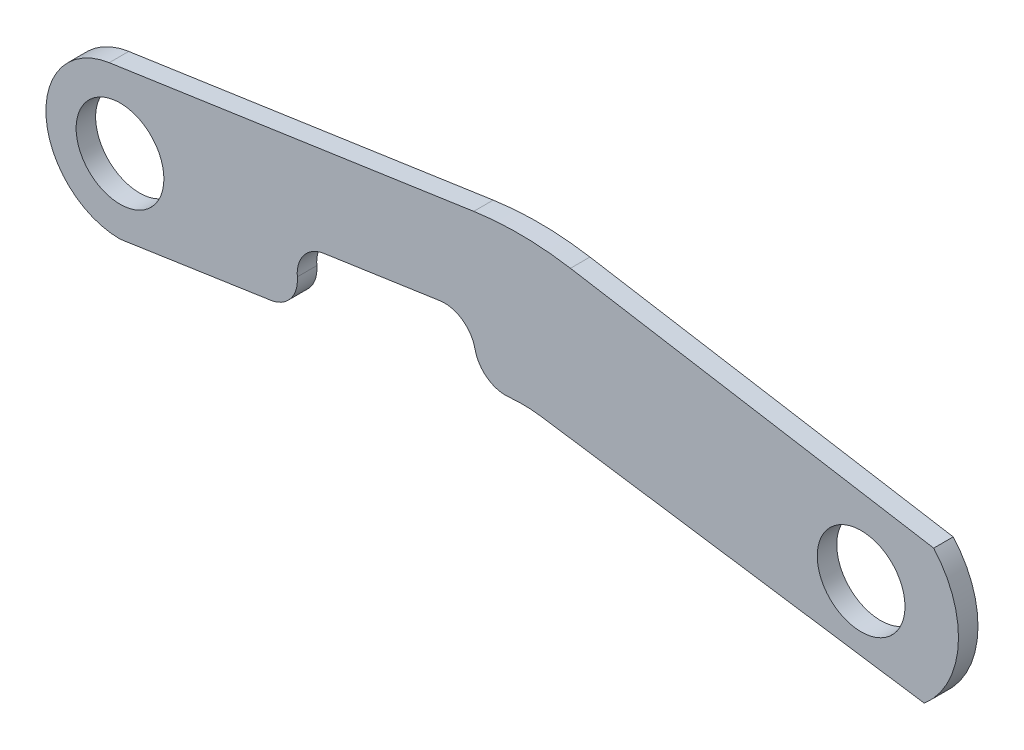
ISO-10303-21;
HEADER;
FILE_DESCRIPTION(('STEP AP214'),'2;1');
FILE_NAME('part.step','',(''),(''),'','','');
FILE_SCHEMA(('AUTOMOTIVE_DESIGN { 1 0 10303 214 1 1 1 1 }'));
ENDSEC;
DATA;
#1=APPLICATION_CONTEXT('core data for automotive mechanical design processes');
#2=APPLICATION_PROTOCOL_DEFINITION('international standard','automotive_design',2000,#1);
#3=PRODUCT_CONTEXT('',#1,'mechanical');
#4=PRODUCT('Part','Part','',(#3));
#5=PRODUCT_RELATED_PRODUCT_CATEGORY('part','',(#4));
#6=PRODUCT_DEFINITION_FORMATION('','',#4);
#7=PRODUCT_DEFINITION_CONTEXT('part definition',#1,'design');
#8=PRODUCT_DEFINITION('design','',#6,#7);
#9=PRODUCT_DEFINITION_SHAPE('','',#8);
#10=(LENGTH_UNIT() NAMED_UNIT(*) SI_UNIT(.MILLI.,.METRE.));
#11=(NAMED_UNIT(*) PLANE_ANGLE_UNIT() SI_UNIT($,.RADIAN.));
#12=(NAMED_UNIT(*) SI_UNIT($,.STERADIAN.) SOLID_ANGLE_UNIT());
#13=UNCERTAINTY_MEASURE_WITH_UNIT(LENGTH_MEASURE(1.E-05),#10,'distance_accuracy_value','');
#14=(GEOMETRIC_REPRESENTATION_CONTEXT(3) GLOBAL_UNCERTAINTY_ASSIGNED_CONTEXT((#13)) GLOBAL_UNIT_ASSIGNED_CONTEXT((#10,
#11,#12)) REPRESENTATION_CONTEXT('',''));
#15=CARTESIAN_POINT('',(0.,0.,0.));
#16=DIRECTION('',(0.,0.,1.));
#17=DIRECTION('',(1.,0.,0.));
#18=AXIS2_PLACEMENT_3D('',#15,#16,#17);
#19=CARTESIAN_POINT('',(-241.3,-0.0733958176190016,6.35));
#20=DIRECTION('',(0.,0.,1.));
#21=DIRECTION('',(1.,0.,0.));
#22=AXIS2_PLACEMENT_3D('',#19,#20,#21);
#23=PLANE('',#22);
#24=CARTESIAN_POINT('',(-241.3,-0.0733958176190016,6.35));
#25=DIRECTION('',(0.,0.,1.));
#26=DIRECTION('',(1.,0.,0.));
#27=AXIS2_PLACEMENT_3D('',#24,#25,#26);
#28=CIRCLE('',#27,14.2875);
#29=CARTESIAN_POINT('',(-227.0125,-0.0733958176190016,6.35));
#30=VERTEX_POINT('',#29);
#31=EDGE_CURVE('E351',#30,#30,#28,.T.);
#32=ORIENTED_EDGE('',*,*,#31,.F.);
#33=EDGE_LOOP('',(#32));
#34=FACE_BOUND('',#33,.T.);
#35=CARTESIAN_POINT('',(-135.644106193781,0.458321889263579,6.35));
#36=DIRECTION('',(0.,0.,1.));
#37=DIRECTION('',(1.,0.,0.));
#38=AXIS2_PLACEMENT_3D('',#35,#36,#37);
#39=CIRCLE('',#38,10.16);
#40=CARTESIAN_POINT('',(-137.11921948996,10.5106669272851,6.35));
#41=VERTEX_POINT('',#40);
#42=CARTESIAN_POINT('',(-125.705830507879,2.56931132339125,6.35));
#43=VERTEX_POINT('',#42);
#44=EDGE_CURVE('E196',#41,#43,#39,.F.);
#45=ORIENTED_EDGE('',*,*,#44,.T.);
#46=CARTESIAN_POINT('',(-115.767554821976,4.68030075751893,6.35));
#47=DIRECTION('',(0.,0.,1.));
#48=DIRECTION('',(1.,0.,0.));
#49=AXIS2_PLACEMENT_3D('',#46,#47,#48);
#50=CIRCLE('',#49,10.16);
#51=CARTESIAN_POINT('',(-114.735835625266,-5.42717941803128,6.35));
#52=VERTEX_POINT('',#51);
#53=EDGE_CURVE('E12',#43,#52,#50,.T.);
#54=ORIENTED_EDGE('',*,*,#53,.T.);
#55=CARTESIAN_POINT('',(-116.702765460223,-5.67369219220193,6.35));
#56=CARTESIAN_POINT('',(-116.173939597988,-5.5950426729444,6.35));
#57=CARTESIAN_POINT('',(-115.643656697061,-5.52622387814941,6.35));
#58=CARTESIAN_POINT('',(-114.580948120513,-5.40832723808446,6.35));
#59=CARTESIAN_POINT('',(-114.048522637467,-5.35924765697801,6.35));
#60=CARTESIAN_POINT('',(-112.982205778447,-5.28089499966019,6.35));
#61=CARTESIAN_POINT('',(-112.448314399348,-5.25162196570139,6.35));
#62=CARTESIAN_POINT('',(-111.379805661741,-5.21291555302155,6.35));
#63=CARTESIAN_POINT('',(-110.845188246209,-5.20348383506026,6.35));
#64=CARTESIAN_POINT('',(-109.259179411638,-5.20498281852525,6.35));
#65=CARTESIAN_POINT('',(-108.207612924795,-5.24439588137648,6.35));
#66=CARTESIAN_POINT('',(-106.634458463651,-5.36099232092721,6.35));
#67=CARTESIAN_POINT('',(-106.110543251673,-5.40947127368151,6.35));
#68=CARTESIAN_POINT('',(-105.064877221161,-5.52553379102556,6.35));
#69=CARTESIAN_POINT('',(-104.543126226508,-5.59311576883675,6.35));
#70=CARTESIAN_POINT('',(-104.022718390291,-5.67021495189014,6.35));
#71=B_SPLINE_CURVE_WITH_KNOTS('',3,(#55,#56,#57,#58,#59,#60,#61,#62,#63,#64,#65,#66,#67,#68,#69,
#70),.UNSPECIFIED.,.F.,.F.,(4,2,2,2,2,2,2,4),(0.,1.60382541193062,3.20750975503436,
4.81119751920764,6.41501951006878,9.56859074734855,11.1467658027899,12.7248098067972),.UNSPECIFIED.);
#72=CARTESIAN_POINT('',(-104.022718390291,-5.67021495189014,6.35));
#73=VERTEX_POINT('',#72);
#74=EDGE_CURVE('E239',#52,#73,#71,.T.);
#75=ORIENTED_EDGE('',*,*,#74,.T.);
#76=DIRECTION('',(0.989202297643112,-0.146556522671589,0.));
#77=VECTOR('',#76,1.);
#78=CARTESIAN_POINT('',(-110.363,-4.73086247799117,6.35));
#79=LINE('',#78,#77);
#80=CARTESIAN_POINT('',(20.574,-24.1299999999839,6.35));
#81=VERTEX_POINT('',#80);
#82=EDGE_CURVE('E360',#73,#81,#79,.T.);
#83=ORIENTED_EDGE('',*,*,#82,.T.);
#84=CARTESIAN_POINT('',(0.,0.,6.35));
#85=DIRECTION('',(0.,0.,1.));
#86=DIRECTION('',(-1.,0.,0.));
#87=AXIS2_PLACEMENT_3D('',#84,#85,#86);
#88=CIRCLE('',#87,31.7103512437062);
#89=CARTESIAN_POINT('',(23.636021604133,21.1396513388508,6.35));
#90=VERTEX_POINT('',#89);
#91=EDGE_CURVE('E363',#81,#90,#88,.T.);
#92=ORIENTED_EDGE('',*,*,#91,.T.);
#93=DIRECTION('',(-0.986326621175531,0.164802294766974,0.));
#94=VECTOR('',#93,1.);
#95=CARTESIAN_POINT('',(-110.363,43.5291375220088,6.35));
#96=LINE('',#95,#94);
#97=CARTESIAN_POINT('',(-94.6400054456516,40.9020305094484,6.35));
#98=VERTEX_POINT('',#97);
#99=EDGE_CURVE('E366',#90,#98,#96,.T.);
#100=ORIENTED_EDGE('',*,*,#99,.T.);
#101=CARTESIAN_POINT('',(-111.383918593976,-59.3087542019855,6.35));
#102=DIRECTION('',(0.,0.,1.));
#103=DIRECTION('',(1.,0.,0.));
#104=AXIS2_PLACEMENT_3D('',#101,#102,#103);
#105=CIRCLE('',#104,101.6);
#106=CARTESIAN_POINT('',(-126.135051555765,41.2146961782299,6.35));
#107=VERTEX_POINT('',#106);
#108=EDGE_CURVE('E186',#98,#107,#105,.T.);
#109=ORIENTED_EDGE('',*,*,#108,.T.);
#110=DIRECTION('',(-0.989404039175348,-0.145188316553041,0.));
#111=VECTOR('',#110,1.);
#112=CARTESIAN_POINT('',(-244.803394078425,23.8009236476821,6.35));
#113=LINE('',#112,#111);
#114=CARTESIAN_POINT('',(-244.803394078425,23.8009236476821,6.35));
#115=VERTEX_POINT('',#114);
#116=EDGE_CURVE('E157',#107,#115,#113,.T.);
#117=ORIENTED_EDGE('',*,*,#116,.T.);
#118=CARTESIAN_POINT('',(-241.3,-0.0733958176190016,6.35));
#119=DIRECTION('',(0.,0.,1.));
#120=DIRECTION('',(1.,0.,0.));
#121=AXIS2_PLACEMENT_3D('',#118,#119,#120);
#122=CIRCLE('',#121,24.13);
#123=CARTESIAN_POINT('',(-241.3,-24.203395817619,6.35));
#124=VERTEX_POINT('',#123);
#125=EDGE_CURVE('E152',#115,#124,#122,.T.);
#126=ORIENTED_EDGE('',*,*,#125,.T.);
#127=DIRECTION('',(0.989121768687304,0.147099037076725,0.));
#128=VECTOR('',#127,1.);
#129=CARTESIAN_POINT('',(-182.186210880628,-15.412181497307,6.35));
#130=LINE('',#129,#128);
#131=CARTESIAN_POINT('',(-192.198553706454,-16.9011852127096,6.35));
#132=VERTEX_POINT('',#131);
#133=EDGE_CURVE('E139',#124,#132,#130,.T.);
#134=ORIENTED_EDGE('',*,*,#133,.T.);
#135=CARTESIAN_POINT('',(-193.693079923154,-6.85170804284661,6.35));
#136=DIRECTION('',(0.,0.,1.));
#137=DIRECTION('',(1.,0.,0.));
#138=AXIS2_PLACEMENT_3D('',#135,#136,#137);
#139=CIRCLE('',#138,10.16);
#140=CARTESIAN_POINT('',(-183.571362995701,-5.97054605970831,6.35));
#141=VERTEX_POINT('',#140);
#142=EDGE_CURVE('E219',#132,#141,#139,.T.);
#143=ORIENTED_EDGE('',*,*,#142,.T.);
#144=CARTESIAN_POINT('',(-173.449646068249,-5.08938407657001,6.35));
#145=DIRECTION('',(0.,0.,1.));
#146=DIRECTION('',(1.,0.,0.));
#147=AXIS2_PLACEMENT_3D('',#144,#145,#146);
#148=CIRCLE('',#147,10.16);
#149=CARTESIAN_POINT('',(-174.924759364428,4.96296096145153,6.35));
#150=VERTEX_POINT('',#149);
#151=EDGE_CURVE('E207',#141,#150,#148,.F.);
#152=ORIENTED_EDGE('',*,*,#151,.T.);
#153=DIRECTION('',(0.989404039175348,0.145188316553042,0.));
#154=VECTOR('',#153,1.);
#155=CARTESIAN_POINT('',(-127.066874451938,11.985780223464,6.35));
#156=LINE('',#155,#154);
#157=EDGE_CURVE('E151',#150,#41,#156,.T.);
#158=ORIENTED_EDGE('',*,*,#157,.T.);
#159=EDGE_LOOP('',(#45,#54,#75,#83,#92,#100,#109,#117,#126,#134,#143,#152,#158));
#160=FACE_BOUND('',#159,.T.);
#161=CARTESIAN_POINT('',(0.,0.,6.35));
#162=DIRECTION('',(0.,0.,1.));
#163=DIRECTION('',(1.,0.,0.));
#164=AXIS2_PLACEMENT_3D('',#161,#162,#163);
#165=CIRCLE('',#164,14.2875);
#166=CARTESIAN_POINT('',(14.2875,0.,6.35));
#167=VERTEX_POINT('',#166);
#168=EDGE_CURVE('E340',#167,#167,#165,.T.);
#169=ORIENTED_EDGE('',*,*,#168,.F.);
#170=EDGE_LOOP('',(#169));
#171=FACE_BOUND('',#170,.T.);
#172=ADVANCED_FACE('F45',(#34,#160,#171),#23,.T.);
#173=CARTESIAN_POINT('',(-241.3,-0.0733958176190016,0.));
#174=DIRECTION('',(0.,0.,1.));
#175=DIRECTION('',(1.,0.,0.));
#176=AXIS2_PLACEMENT_3D('',#173,#174,#175);
#177=PLANE('',#176);
#178=CARTESIAN_POINT('',(-104.022718390291,-5.67021495189014,0.));
#179=CARTESIAN_POINT('',(-104.551587308989,-5.59185548352197,0.));
#180=CARTESIAN_POINT('',(-105.081907874415,-5.52332753726308,0.));
#181=CARTESIAN_POINT('',(-106.144680952548,-5.40601376652432,0.));
#182=CARTESIAN_POINT('',(-106.67713327363,-5.35722620610259,0.));
#183=CARTESIAN_POINT('',(-107.743492945457,-5.27945839115674,0.));
#184=CARTESIAN_POINT('',(-108.277400299302,-5.25047817888689,0.));
#185=CARTESIAN_POINT('',(-109.345930105065,-5.21235780477063,0.));
#186=CARTESIAN_POINT('',(-109.880552613095,-5.20321930371497,0.));
#187=CARTESIAN_POINT('',(-111.466560386994,-5.20558814704404,0.));
#188=CARTESIAN_POINT('',(-112.518105099247,-5.24557794458728,0.));
#189=CARTESIAN_POINT('',(-114.09119537547,-5.36303717660016,0.));
#190=CARTESIAN_POINT('',(-114.615083919954,-5.41180346783521,0.));
#191=CARTESIAN_POINT('',(-115.660686137716,-5.52843947218728,0.));
#192=CARTESIAN_POINT('',(-116.182399987983,-5.59630759862257,0.));
#193=CARTESIAN_POINT('',(-116.702765460223,-5.67369219220193,0.));
#194=B_SPLINE_CURVE_WITH_KNOTS('',3,(#178,#179,#180,#181,#182,#183,#184,#185,#186,#187,#188,
#189,#190,#191,#192,#193),.UNSPECIFIED.,.F.,.F.,(4,2,2,2,2,2,2,4),(0.,1.60382541193061,
3.20750975503434,4.81119751920763,6.41501951006877,9.56859074734855,11.14676580279,
12.7248098067972),.UNSPECIFIED.);
#195=CARTESIAN_POINT('',(-104.022718390291,-5.67021495189014,0.));
#196=VERTEX_POINT('',#195);
#197=CARTESIAN_POINT('',(-114.735835625266,-5.42717941803128,0.));
#198=VERTEX_POINT('',#197);
#199=EDGE_CURVE('E228',#196,#198,#194,.T.);
#200=ORIENTED_EDGE('',*,*,#199,.T.);
#201=CARTESIAN_POINT('',(-115.767554821976,4.68030075751894,0.));
#202=DIRECTION('',(0.,0.,1.));
#203=DIRECTION('',(1.,0.,0.));
#204=AXIS2_PLACEMENT_3D('',#201,#202,#203);
#205=CIRCLE('',#204,10.16);
#206=CARTESIAN_POINT('',(-125.705830507879,2.56931132339126,0.));
#207=VERTEX_POINT('',#206);
#208=EDGE_CURVE('E67',#198,#207,#205,.F.);
#209=ORIENTED_EDGE('',*,*,#208,.T.);
#210=CARTESIAN_POINT('',(-135.644106193781,0.458321889263579,0.));
#211=DIRECTION('',(0.,0.,1.));
#212=DIRECTION('',(1.,0.,0.));
#213=AXIS2_PLACEMENT_3D('',#210,#211,#212);
#214=CIRCLE('',#213,10.16);
#215=CARTESIAN_POINT('',(-137.11921948996,10.5106669272851,0.));
#216=VERTEX_POINT('',#215);
#217=EDGE_CURVE('E193',#207,#216,#214,.T.);
#218=ORIENTED_EDGE('',*,*,#217,.T.);
#219=DIRECTION('',(0.989404039175348,0.145188316553042,0.));
#220=VECTOR('',#219,1.);
#221=CARTESIAN_POINT('',(-127.066874451938,11.985780223464,0.));
#222=LINE('',#221,#220);
#223=CARTESIAN_POINT('',(-174.924759364428,4.96296096145153,0.));
#224=VERTEX_POINT('',#223);
#225=EDGE_CURVE('E378',#224,#216,#222,.T.);
#226=ORIENTED_EDGE('',*,*,#225,.F.);
#227=CARTESIAN_POINT('',(-173.449646068249,-5.08938407657001,0.));
#228=DIRECTION('',(0.,0.,1.));
#229=DIRECTION('',(1.,0.,0.));
#230=AXIS2_PLACEMENT_3D('',#227,#228,#229);
#231=CIRCLE('',#230,10.16);
#232=CARTESIAN_POINT('',(-183.571362995701,-5.97054605970831,0.));
#233=VERTEX_POINT('',#232);
#234=EDGE_CURVE('E203',#224,#233,#231,.T.);
#235=ORIENTED_EDGE('',*,*,#234,.T.);
#236=CARTESIAN_POINT('',(-193.693079923154,-6.85170804284661,0.));
#237=DIRECTION('',(0.,0.,1.));
#238=DIRECTION('',(1.,0.,0.));
#239=AXIS2_PLACEMENT_3D('',#236,#237,#238);
#240=CIRCLE('',#239,10.16);
#241=CARTESIAN_POINT('',(-192.198553706454,-16.9011852127096,0.));
#242=VERTEX_POINT('',#241);
#243=EDGE_CURVE('E214',#233,#242,#240,.F.);
#244=ORIENTED_EDGE('',*,*,#243,.T.);
#245=DIRECTION('',(0.989121768687304,0.147099037076725,0.));
#246=VECTOR('',#245,1.);
#247=CARTESIAN_POINT('',(-182.186210880628,-15.412181497307,0.));
#248=LINE('',#247,#246);
#249=CARTESIAN_POINT('',(-241.3,-24.203395817619,0.));
#250=VERTEX_POINT('',#249);
#251=EDGE_CURVE('E375',#250,#242,#248,.T.);
#252=ORIENTED_EDGE('',*,*,#251,.F.);
#253=CARTESIAN_POINT('',(-241.3,-0.0733958176190016,0.));
#254=DIRECTION('',(0.,0.,1.));
#255=DIRECTION('',(1.,0.,0.));
#256=AXIS2_PLACEMENT_3D('',#253,#254,#255);
#257=CIRCLE('',#256,24.13);
#258=CARTESIAN_POINT('',(-244.803394078425,23.8009236476821,0.));
#259=VERTEX_POINT('',#258);
#260=EDGE_CURVE('E166',#259,#250,#257,.T.);
#261=ORIENTED_EDGE('',*,*,#260,.F.);
#262=DIRECTION('',(-0.989404039175348,-0.145188316553041,0.));
#263=VECTOR('',#262,1.);
#264=CARTESIAN_POINT('',(-244.803394078425,23.8009236476821,0.));
#265=LINE('',#264,#263);
#266=CARTESIAN_POINT('',(-126.135051555765,41.2146961782299,0.));
#267=VERTEX_POINT('',#266);
#268=EDGE_CURVE('E162',#267,#259,#265,.T.);
#269=ORIENTED_EDGE('',*,*,#268,.F.);
#270=CARTESIAN_POINT('',(-111.383918593976,-59.3087542019855,0.));
#271=DIRECTION('',(0.,0.,1.));
#272=DIRECTION('',(1.,0.,0.));
#273=AXIS2_PLACEMENT_3D('',#270,#271,#272);
#274=CIRCLE('',#273,101.6);
#275=CARTESIAN_POINT('',(-94.6400054456516,40.9020305094484,0.));
#276=VERTEX_POINT('',#275);
#277=EDGE_CURVE('E174',#267,#276,#274,.F.);
#278=ORIENTED_EDGE('',*,*,#277,.T.);
#279=DIRECTION('',(-0.986326621175531,0.164802294766974,0.));
#280=VECTOR('',#279,1.);
#281=CARTESIAN_POINT('',(-110.363,43.5291375220088,0.));
#282=LINE('',#281,#280);
#283=CARTESIAN_POINT('',(23.636021604133,21.1396513388508,0.));
#284=VERTEX_POINT('',#283);
#285=EDGE_CURVE('E388',#284,#276,#282,.T.);
#286=ORIENTED_EDGE('',*,*,#285,.F.);
#287=CARTESIAN_POINT('',(0.,0.,0.));
#288=DIRECTION('',(0.,0.,1.));
#289=DIRECTION('',(-1.,0.,0.));
#290=AXIS2_PLACEMENT_3D('',#287,#288,#289);
#291=CIRCLE('',#290,31.7103512437062);
#292=CARTESIAN_POINT('',(20.574,-24.1299999999839,0.));
#293=VERTEX_POINT('',#292);
#294=EDGE_CURVE('E385',#293,#284,#291,.T.);
#295=ORIENTED_EDGE('',*,*,#294,.F.);
#296=DIRECTION('',(0.989202297643112,-0.146556522671589,0.));
#297=VECTOR('',#296,1.);
#298=CARTESIAN_POINT('',(-110.363,-4.73086247799117,0.));
#299=LINE('',#298,#297);
#300=EDGE_CURVE('E382',#196,#293,#299,.T.);
#301=ORIENTED_EDGE('',*,*,#300,.F.);
#302=EDGE_LOOP('',(#200,#209,#218,#226,#235,#244,#252,#261,#269,#278,#286,#295,#301));
#303=FACE_BOUND('',#302,.T.);
#304=CARTESIAN_POINT('',(-241.3,-0.0733958176190016,0.));
#305=DIRECTION('',(0.,0.,1.));
#306=DIRECTION('',(1.,0.,0.));
#307=AXIS2_PLACEMENT_3D('',#304,#305,#306);
#308=CIRCLE('',#307,14.2875);
#309=CARTESIAN_POINT('',(-227.0125,-0.0733958176190016,0.));
#310=VERTEX_POINT('',#309);
#311=EDGE_CURVE('E348',#310,#310,#308,.T.);
#312=ORIENTED_EDGE('',*,*,#311,.T.);
#313=EDGE_LOOP('',(#312));
#314=FACE_BOUND('',#313,.T.);
#315=CARTESIAN_POINT('',(0.,0.,0.));
#316=DIRECTION('',(0.,0.,1.));
#317=DIRECTION('',(1.,0.,0.));
#318=AXIS2_PLACEMENT_3D('',#315,#316,#317);
#319=CIRCLE('',#318,14.2875);
#320=CARTESIAN_POINT('',(14.2875,0.,0.));
#321=VERTEX_POINT('',#320);
#322=EDGE_CURVE('E343',#321,#321,#319,.T.);
#323=ORIENTED_EDGE('',*,*,#322,.T.);
#324=EDGE_LOOP('',(#323));
#325=FACE_BOUND('',#324,.T.);
#326=ADVANCED_FACE('F246',(#303,#314,#325),#177,.F.);
#327=CARTESIAN_POINT('',(-241.3,-0.0733958176190016,6.35));
#328=DIRECTION('',(0.,0.,-1.));
#329=DIRECTION('',(-1.,0.,0.));
#330=AXIS2_PLACEMENT_3D('',#327,#328,#329);
#331=CYLINDRICAL_SURFACE('',#330,24.13);
#332=ORIENTED_EDGE('',*,*,#260,.T.);
#333=DIRECTION('',(0.,0.,-1.));
#334=VECTOR('',#333,1.);
#335=CARTESIAN_POINT('',(-241.3,-24.203395817619,6.35));
#336=LINE('',#335,#334);
#337=EDGE_CURVE('E144',#124,#250,#336,.T.);
#338=ORIENTED_EDGE('',*,*,#337,.F.);
#339=ORIENTED_EDGE('',*,*,#125,.F.);
#340=DIRECTION('',(0.,0.,-1.));
#341=VECTOR('',#340,1.);
#342=CARTESIAN_POINT('',(-244.803394078425,23.8009236476821,6.35));
#343=LINE('',#342,#341);
#344=EDGE_CURVE('E372',#115,#259,#343,.T.);
#345=ORIENTED_EDGE('',*,*,#344,.T.);
#346=EDGE_LOOP('',(#332,#338,#339,#345));
#347=FACE_BOUND('',#346,.T.);
#348=ADVANCED_FACE('F164',(#347),#331,.T.);
#349=CARTESIAN_POINT('',(-182.186210880628,-15.412181497307,6.35));
#350=DIRECTION('',(-0.147099037076725,0.989121768687304,0.));
#351=DIRECTION('',(-0.989121768687304,-0.147099037076725,0.));
#352=AXIS2_PLACEMENT_3D('',#349,#350,#351);
#353=PLANE('',#352);
#354=ORIENTED_EDGE('',*,*,#251,.T.);
#355=DIRECTION('',(0.,0.,1.));
#356=VECTOR('',#355,1.);
#357=CARTESIAN_POINT('',(-192.198553706454,-16.9011852127096,6.35));
#358=LINE('',#357,#356);
#359=EDGE_CURVE('E147',#242,#132,#358,.T.);
#360=ORIENTED_EDGE('',*,*,#359,.T.);
#361=ORIENTED_EDGE('',*,*,#133,.F.);
#362=ORIENTED_EDGE('',*,*,#337,.T.);
#363=EDGE_LOOP('',(#354,#360,#361,#362));
#364=FACE_BOUND('',#363,.T.);
#365=ADVANCED_FACE('F142',(#364),#353,.F.);
#366=CARTESIAN_POINT('',(-127.066874451938,11.985780223464,6.35));
#367=DIRECTION('',(-0.145188316553042,0.989404039175348,0.));
#368=DIRECTION('',(-0.989404039175348,-0.145188316553042,0.));
#369=AXIS2_PLACEMENT_3D('',#366,#367,#368);
#370=PLANE('',#369);
#371=ORIENTED_EDGE('',*,*,#157,.F.);
#372=DIRECTION('',(0.,0.,-1.));
#373=VECTOR('',#372,1.);
#374=CARTESIAN_POINT('',(-174.924759364428,4.96296096145153,0.));
#375=LINE('',#374,#373);
#376=EDGE_CURVE('E199',#150,#224,#375,.T.);
#377=ORIENTED_EDGE('',*,*,#376,.T.);
#378=ORIENTED_EDGE('',*,*,#225,.T.);
#379=DIRECTION('',(0.,0.,-1.));
#380=VECTOR('',#379,1.);
#381=CARTESIAN_POINT('',(-137.11921948996,10.5106669272851,6.35));
#382=LINE('',#381,#380);
#383=EDGE_CURVE('E189',#216,#41,#382,.F.);
#384=ORIENTED_EDGE('',*,*,#383,.T.);
#385=EDGE_LOOP('',(#371,#377,#378,#384));
#386=FACE_BOUND('',#385,.T.);
#387=ADVANCED_FACE('F301',(#386),#370,.F.);
#388=CARTESIAN_POINT('',(-110.363,-4.73086247799117,6.35));
#389=DIRECTION('',(0.146556522671589,0.989202297643112,0.));
#390=DIRECTION('',(-0.989202297643112,0.146556522671589,0.));
#391=AXIS2_PLACEMENT_3D('',#388,#389,#390);
#392=PLANE('',#391);
#393=ORIENTED_EDGE('',*,*,#82,.F.);
#394=CARTESIAN_POINT('',(-104.022718390291,-5.67021495189014,19.05));
#395=CARTESIAN_POINT('',(-104.022718390291,-5.67021495189014,14.8166666666667));
#396=CARTESIAN_POINT('',(-104.022718390291,-5.67021495189014,10.5833333333333));
#397=CARTESIAN_POINT('',(-104.022718390291,-5.67021495189014,6.35));
#398=CARTESIAN_POINT('',(-104.022718390291,-5.67021495189014,4.23333333333334));
#399=CARTESIAN_POINT('',(-104.022718390291,-5.67021495189014,2.11666666666667));
#400=CARTESIAN_POINT('',(-104.022718390291,-5.67021495189014,0.));
#401=CARTESIAN_POINT('',(-104.022718390291,-5.67021495189014,-4.23333333333333));
#402=CARTESIAN_POINT('',(-104.022718390291,-5.67021495189014,-8.46666666666666));
#403=CARTESIAN_POINT('',(-104.022718390291,-5.67021495189014,-12.7));
#404=(BOUNDED_CURVE() B_SPLINE_CURVE(3,(#394,#395,#396,#397,#398,#399,#400,#401,#402,#403),
.UNSPECIFIED.,.F.,.F.) B_SPLINE_CURVE_WITH_KNOTS((4,3,3,4),(-0.0127,0.,0.00635,0.01905),
.UNSPECIFIED.) CURVE() GEOMETRIC_REPRESENTATION_ITEM() RATIONAL_B_SPLINE_CURVE((1.,1.,1.,1.,1.,
1.,1.,1.,1.,1.)) REPRESENTATION_ITEM(''));
#405=EDGE_CURVE('E222',#73,#196,#404,.T.);
#406=ORIENTED_EDGE('',*,*,#405,.T.);
#407=ORIENTED_EDGE('',*,*,#300,.T.);
#408=DIRECTION('',(0.,0.,-1.));
#409=VECTOR('',#408,1.);
#410=CARTESIAN_POINT('',(20.574,-24.1299999999839,6.35));
#411=LINE('',#410,#409);
#412=EDGE_CURVE('E169',#81,#293,#411,.T.);
#413=ORIENTED_EDGE('',*,*,#412,.F.);
#414=EDGE_LOOP('',(#393,#406,#407,#413));
#415=FACE_BOUND('',#414,.T.);
#416=ADVANCED_FACE('F304',(#415),#392,.F.);
#417=CARTESIAN_POINT('',(0.,0.,6.35));
#418=DIRECTION('',(0.,0.,-1.));
#419=DIRECTION('',(-1.,0.,0.));
#420=AXIS2_PLACEMENT_3D('',#417,#418,#419);
#421=CYLINDRICAL_SURFACE('',#420,31.7103512437062);
#422=ORIENTED_EDGE('',*,*,#294,.T.);
#423=DIRECTION('',(0.,0.,-1.));
#424=VECTOR('',#423,1.);
#425=CARTESIAN_POINT('',(23.636021604133,21.1396513388508,6.35));
#426=LINE('',#425,#424);
#427=EDGE_CURVE('E177',#90,#284,#426,.T.);
#428=ORIENTED_EDGE('',*,*,#427,.F.);
#429=ORIENTED_EDGE('',*,*,#91,.F.);
#430=ORIENTED_EDGE('',*,*,#412,.T.);
#431=EDGE_LOOP('',(#422,#428,#429,#430));
#432=FACE_BOUND('',#431,.T.);
#433=ADVANCED_FACE('F308',(#432),#421,.T.);
#434=CARTESIAN_POINT('',(-110.363,43.5291375220088,6.35));
#435=DIRECTION('',(-0.164802294766974,-0.986326621175531,0.));
#436=DIRECTION('',(0.986326621175531,-0.164802294766974,0.));
#437=AXIS2_PLACEMENT_3D('',#434,#435,#436);
#438=PLANE('',#437);
#439=ORIENTED_EDGE('',*,*,#285,.T.);
#440=DIRECTION('',(0.,0.,-1.));
#441=VECTOR('',#440,1.);
#442=CARTESIAN_POINT('',(-94.6400054456516,40.9020305094484,6.35));
#443=LINE('',#442,#441);
#444=EDGE_CURVE('E183',#276,#98,#443,.F.);
#445=ORIENTED_EDGE('',*,*,#444,.T.);
#446=ORIENTED_EDGE('',*,*,#99,.F.);
#447=ORIENTED_EDGE('',*,*,#427,.T.);
#448=EDGE_LOOP('',(#439,#445,#446,#447));
#449=FACE_BOUND('',#448,.T.);
#450=ADVANCED_FACE('F312',(#449),#438,.F.);
#451=CARTESIAN_POINT('',(-244.803394078425,23.8009236476821,6.35));
#452=DIRECTION('',(0.145188316553041,-0.989404039175348,0.));
#453=DIRECTION('',(0.989404039175348,0.145188316553041,0.));
#454=AXIS2_PLACEMENT_3D('',#451,#452,#453);
#455=PLANE('',#454);
#456=ORIENTED_EDGE('',*,*,#116,.F.);
#457=DIRECTION('',(0.,0.,-1.));
#458=VECTOR('',#457,1.);
#459=CARTESIAN_POINT('',(-126.135051555765,41.2146961782299,6.35));
#460=LINE('',#459,#458);
#461=EDGE_CURVE('E168',#107,#267,#460,.T.);
#462=ORIENTED_EDGE('',*,*,#461,.T.);
#463=ORIENTED_EDGE('',*,*,#268,.T.);
#464=ORIENTED_EDGE('',*,*,#344,.F.);
#465=EDGE_LOOP('',(#456,#462,#463,#464));
#466=FACE_BOUND('',#465,.T.);
#467=ADVANCED_FACE('F315',(#466),#455,.F.);
#468=CARTESIAN_POINT('',(-241.3,-0.0733958176190016,6.35));
#469=DIRECTION('',(0.,0.,-1.));
#470=DIRECTION('',(-1.,0.,0.));
#471=AXIS2_PLACEMENT_3D('',#468,#469,#470);
#472=CYLINDRICAL_SURFACE('',#471,14.2875);
#473=ORIENTED_EDGE('',*,*,#31,.T.);
#474=EDGE_LOOP('',(#473));
#475=FACE_BOUND('',#474,.T.);
#476=ORIENTED_EDGE('',*,*,#311,.F.);
#477=EDGE_LOOP('',(#476));
#478=FACE_BOUND('',#477,.T.);
#479=ADVANCED_FACE('F318',(#475,#478),#472,.F.);
#480=CARTESIAN_POINT('',(0.,0.,6.35));
#481=DIRECTION('',(0.,0.,-1.));
#482=DIRECTION('',(-1.,0.,0.));
#483=AXIS2_PLACEMENT_3D('',#480,#481,#482);
#484=CYLINDRICAL_SURFACE('',#483,14.2875);
#485=ORIENTED_EDGE('',*,*,#168,.T.);
#486=EDGE_LOOP('',(#485));
#487=FACE_BOUND('',#486,.T.);
#488=ORIENTED_EDGE('',*,*,#322,.F.);
#489=EDGE_LOOP('',(#488));
#490=FACE_BOUND('',#489,.T.);
#491=ADVANCED_FACE('F295',(#487,#490),#484,.F.);
#492=CARTESIAN_POINT('',(-111.383918593976,-59.3087542019855,6.35));
#493=DIRECTION('',(0.,0.,-1.));
#494=DIRECTION('',(-1.,0.,0.));
#495=AXIS2_PLACEMENT_3D('',#492,#493,#494);
#496=CYLINDRICAL_SURFACE('',#495,101.6);
#497=ORIENTED_EDGE('',*,*,#108,.F.);
#498=ORIENTED_EDGE('',*,*,#444,.F.);
#499=ORIENTED_EDGE('',*,*,#277,.F.);
#500=ORIENTED_EDGE('',*,*,#461,.F.);
#501=EDGE_LOOP('',(#497,#498,#499,#500));
#502=FACE_BOUND('',#501,.T.);
#503=ADVANCED_FACE('F292',(#502),#496,.T.);
#504=CARTESIAN_POINT('',(-135.644106193781,0.458321889263579,6.35));
#505=DIRECTION('',(0.,0.,1.));
#506=DIRECTION('',(1.,0.,0.));
#507=AXIS2_PLACEMENT_3D('',#504,#505,#506);
#508=CYLINDRICAL_SURFACE('',#507,10.16);
#509=ORIENTED_EDGE('',*,*,#217,.F.);
#510=DIRECTION('',(0.,0.,1.));
#511=VECTOR('',#510,1.);
#512=CARTESIAN_POINT('',(-125.705830507879,2.56931132339125,6.35));
#513=LINE('',#512,#511);
#514=EDGE_CURVE('E53',#207,#43,#513,.T.);
#515=ORIENTED_EDGE('',*,*,#514,.T.);
#516=ORIENTED_EDGE('',*,*,#44,.F.);
#517=ORIENTED_EDGE('',*,*,#383,.F.);
#518=EDGE_LOOP('',(#509,#515,#516,#517));
#519=FACE_BOUND('',#518,.T.);
#520=ADVANCED_FACE('F288',(#519),#508,.F.);
#521=CARTESIAN_POINT('',(-173.449646068249,-5.08938407657001,6.35));
#522=DIRECTION('',(0.,0.,1.));
#523=DIRECTION('',(1.,0.,0.));
#524=AXIS2_PLACEMENT_3D('',#521,#522,#523);
#525=CYLINDRICAL_SURFACE('',#524,10.16);
#526=ORIENTED_EDGE('',*,*,#151,.F.);
#527=DIRECTION('',(0.,0.,1.));
#528=VECTOR('',#527,1.);
#529=CARTESIAN_POINT('',(-183.571362995701,-5.97054605970831,6.35));
#530=LINE('',#529,#528);
#531=EDGE_CURVE('E210',#141,#233,#530,.F.);
#532=ORIENTED_EDGE('',*,*,#531,.T.);
#533=ORIENTED_EDGE('',*,*,#234,.F.);
#534=ORIENTED_EDGE('',*,*,#376,.F.);
#535=EDGE_LOOP('',(#526,#532,#533,#534));
#536=FACE_BOUND('',#535,.T.);
#537=ADVANCED_FACE('F284',(#536),#525,.F.);
#538=CARTESIAN_POINT('',(-193.693079923154,-6.85170804284661,6.35));
#539=DIRECTION('',(0.,0.,1.));
#540=DIRECTION('',(1.,0.,0.));
#541=AXIS2_PLACEMENT_3D('',#538,#539,#540);
#542=CYLINDRICAL_SURFACE('',#541,10.16);
#543=ORIENTED_EDGE('',*,*,#142,.F.);
#544=ORIENTED_EDGE('',*,*,#359,.F.);
#545=ORIENTED_EDGE('',*,*,#243,.F.);
#546=ORIENTED_EDGE('',*,*,#531,.F.);
#547=EDGE_LOOP('',(#543,#544,#545,#546));
#548=FACE_BOUND('',#547,.T.);
#549=ADVANCED_FACE('F258',(#548),#542,.T.);
#550=CARTESIAN_POINT('',(-104.022718390291,-5.67021495189014,7.62));
#551=CARTESIAN_POINT('',(-104.022718390291,-5.67021495189014,7.19666666666667));
#552=CARTESIAN_POINT('',(-104.022718390291,-5.67021495189014,6.77333333333334));
#553=CARTESIAN_POINT('',(-104.022718390291,-5.67021495189014,6.35));
#554=CARTESIAN_POINT('',(-104.022718390291,-5.67021495189014,4.23333333333334));
#555=CARTESIAN_POINT('',(-104.022718390291,-5.67021495189014,2.11666666666667));
#556=CARTESIAN_POINT('',(-104.022718390291,-5.67021495189014,0.));
#557=CARTESIAN_POINT('',(-104.022718390291,-5.67021495189014,-0.423333333333332));
#558=CARTESIAN_POINT('',(-104.022718390291,-5.67021495189014,-0.846666666666666));
#559=CARTESIAN_POINT('',(-104.022718390291,-5.67021495189014,-1.27));
#560=CARTESIAN_POINT('',(-110.363,-4.73086247799117,7.62000000000001));
#561=CARTESIAN_POINT('',(-110.363,-4.73086247799117,7.19666666666667));
#562=CARTESIAN_POINT('',(-110.363,-4.73086247799117,6.77333333333334));
#563=CARTESIAN_POINT('',(-110.363,-4.73086247799117,6.35));
#564=CARTESIAN_POINT('',(-110.363,-4.73086247799117,4.23333333333334));
#565=CARTESIAN_POINT('',(-110.363,-4.73086247799117,2.11666666666667));
#566=CARTESIAN_POINT('',(-110.363,-4.73086247799117,0.));
#567=CARTESIAN_POINT('',(-110.363,-4.73086247799117,-0.423333333333332));
#568=CARTESIAN_POINT('',(-110.363,-4.73086247799117,-0.846666666666667));
#569=CARTESIAN_POINT('',(-110.363,-4.73086247799117,-1.27));
#570=CARTESIAN_POINT('',(-116.702765460223,-5.67369219220193,7.62));
#571=CARTESIAN_POINT('',(-116.702765460223,-5.67369219220193,7.19666666666667));
#572=CARTESIAN_POINT('',(-116.702765460223,-5.67369219220193,6.77333333333334));
#573=CARTESIAN_POINT('',(-116.702765460223,-5.67369219220193,6.35));
#574=CARTESIAN_POINT('',(-116.702765460223,-5.67369219220193,4.23333333333334));
#575=CARTESIAN_POINT('',(-116.702765460223,-5.67369219220193,2.11666666666667));
#576=CARTESIAN_POINT('',(-116.702765460223,-5.67369219220193,0.));
#577=CARTESIAN_POINT('',(-116.702765460223,-5.67369219220193,-0.423333333333332));
#578=CARTESIAN_POINT('',(-116.702765460223,-5.67369219220193,-0.846666666666666));
#579=CARTESIAN_POINT('',(-116.702765460223,-5.67369219220193,-1.27));
#580=(BOUNDED_SURFACE() B_SPLINE_SURFACE(2,3,((#550,#551,#552,#553,#554,#555,#556,#557,#558,
#559),(#560,#561,#562,#563,#564,#565,#566,#567,#568,#569),(#570,#571,#572,#573,#574,#575,#576,
#577,#578,#579)),.UNSPECIFIED.,.F.,.F.,.F.) B_SPLINE_SURFACE_WITH_KNOTS((3,3),(4,3,3,4),(0.,1.),
(-0.00127,0.,0.00635,0.00762),
.UNSPECIFIED.) GEOMETRIC_REPRESENTATION_ITEM() RATIONAL_B_SPLINE_SURFACE(((1.,1.,1.,1.,1.,1.,1.,
1.,1.,1.),(0.989162070358542,0.989162070358542,0.989162070358542,0.989162070358542,
0.989162070358542,0.989162070358542,0.989162070358542,0.989162070358542,0.989162070358542,
0.989162070358542),(1.,1.,1.,1.,1.,1.,1.,1.,1.,1.))) REPRESENTATION_ITEM('') SURFACE());
#581=DIRECTION('',(0.,0.,-1.));
#582=VECTOR('',#581,1.);
#583=CARTESIAN_POINT('',(-114.735835625266,-5.42717941803128,6.35));
#584=LINE('',#583,#582);
#585=EDGE_CURVE('E420',#52,#198,#584,.T.);
#586=ORIENTED_EDGE('',*,*,#74,.F.);
#587=ORIENTED_EDGE('',*,*,#585,.T.);
#588=ORIENTED_EDGE('',*,*,#199,.F.);
#589=ORIENTED_EDGE('',*,*,#405,.F.);
#590=EDGE_LOOP('',(#586,#587,#588,#589));
#591=FACE_BOUND('',#590,.T.);
#592=ADVANCED_FACE('F250',(#591),#580,.T.);
#593=CARTESIAN_POINT('',(-115.767554821976,4.68030075751894,0.));
#594=DIRECTION('',(0.,0.,-1.));
#595=DIRECTION('',(0.,1.,0.));
#596=AXIS2_PLACEMENT_3D('',#593,#594,#595);
#597=CYLINDRICAL_SURFACE('',#596,10.16);
#598=ORIENTED_EDGE('',*,*,#53,.F.);
#599=ORIENTED_EDGE('',*,*,#514,.F.);
#600=ORIENTED_EDGE('',*,*,#208,.F.);
#601=ORIENTED_EDGE('',*,*,#585,.F.);
#602=EDGE_LOOP('',(#598,#599,#600,#601));
#603=FACE_BOUND('',#602,.T.);
#604=ADVANCED_FACE('F47',(#603),#597,.T.);
#605=CLOSED_SHELL('',(#172,#326,#348,#365,#387,#416,#433,#450,#467,#479,#491,#503,#520,#537,
#549,#592,#604));
#606=MANIFOLD_SOLID_BREP('B2',#605);
#607=ADVANCED_BREP_SHAPE_REPRESENTATION('',(#18,#606),#14);
#608=SHAPE_DEFINITION_REPRESENTATION(#9,#607);
ENDSEC;
END-ISO-10303-21;
